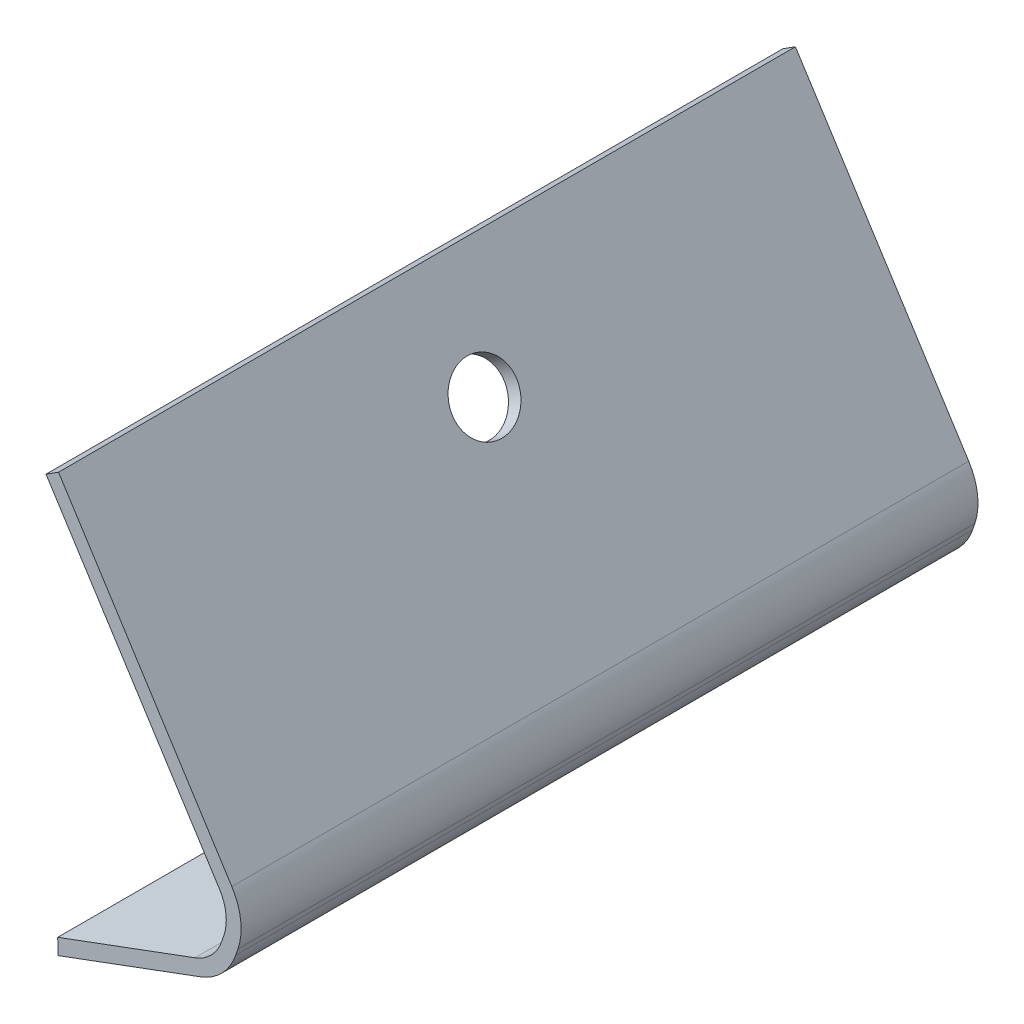
ISO-10303-21;
HEADER;
FILE_DESCRIPTION(('STEP AP214'),'2;1');
FILE_NAME('part.step','',(''),(''),'','','');
FILE_SCHEMA(('AUTOMOTIVE_DESIGN { 1 0 10303 214 1 1 1 1 }'));
ENDSEC;
DATA;
#1=APPLICATION_CONTEXT('core data for automotive mechanical design processes');
#2=APPLICATION_PROTOCOL_DEFINITION('international standard','automotive_design',2000,#1);
#3=PRODUCT_CONTEXT('',#1,'mechanical');
#4=PRODUCT('Part','Part','',(#3));
#5=PRODUCT_RELATED_PRODUCT_CATEGORY('part','',(#4));
#6=PRODUCT_DEFINITION_FORMATION('','',#4);
#7=PRODUCT_DEFINITION_CONTEXT('part definition',#1,'design');
#8=PRODUCT_DEFINITION('design','',#6,#7);
#9=PRODUCT_DEFINITION_SHAPE('','',#8);
#10=(LENGTH_UNIT() NAMED_UNIT(*) SI_UNIT(.MILLI.,.METRE.));
#11=(NAMED_UNIT(*) PLANE_ANGLE_UNIT() SI_UNIT($,.RADIAN.));
#12=(NAMED_UNIT(*) SI_UNIT($,.STERADIAN.) SOLID_ANGLE_UNIT());
#13=UNCERTAINTY_MEASURE_WITH_UNIT(LENGTH_MEASURE(1.E-05),#10,'distance_accuracy_value','');
#14=(GEOMETRIC_REPRESENTATION_CONTEXT(3) GLOBAL_UNCERTAINTY_ASSIGNED_CONTEXT((#13)) GLOBAL_UNIT_ASSIGNED_CONTEXT((#10,
#11,#12)) REPRESENTATION_CONTEXT('',''));
#15=CARTESIAN_POINT('',(0.,0.,0.));
#16=DIRECTION('',(0.,0.,1.));
#17=DIRECTION('',(1.,0.,0.));
#18=AXIS2_PLACEMENT_3D('',#15,#16,#17);
#19=CARTESIAN_POINT('',(26.2680473897416,-9.84429719392655,-206.898478212242));
#20=DIRECTION('',(0.,0.,1.));
#21=DIRECTION('',(1.,0.,0.));
#22=AXIS2_PLACEMENT_3D('',#19,#20,#21);
#23=CYLINDRICAL_SURFACE('',#22,10.16);
#24=CARTESIAN_POINT('',(26.2680473897416,-9.84429719392655,-127.762000000019));
#25=DIRECTION('',(0.,0.,-1.));
#26=DIRECTION('',(-1.,0.,0.));
#27=AXIS2_PLACEMENT_3D('',#24,#25,#26);
#28=CIRCLE('',#27,10.16);
#29=CARTESIAN_POINT('',(35.8829619273925,-13.1274387433683,-127.762000000019));
#30=VERTEX_POINT('',#29);
#31=CARTESIAN_POINT('',(29.8006851500185,-19.3703703856811,-127.762000000019));
#32=VERTEX_POINT('',#31);
#33=EDGE_CURVE('E170',#30,#32,#28,.T.);
#34=ORIENTED_EDGE('',*,*,#33,.F.);
#35=DIRECTION('',(0.,0.,1.));
#36=VECTOR('',#35,1.);
#37=CARTESIAN_POINT('',(35.8829619273925,-13.1274387433683,-206.898478212242));
#38=LINE('',#37,#36);
#39=CARTESIAN_POINT('',(35.8829619273925,-13.1274387433683,-1.5748));
#40=VERTEX_POINT('',#39);
#41=EDGE_CURVE('E37',#30,#40,#38,.T.);
#42=ORIENTED_EDGE('',*,*,#41,.T.);
#43=CARTESIAN_POINT('',(26.2680473897416,-9.84429719392655,-1.5748));
#44=DIRECTION('',(0.,0.,-1.));
#45=DIRECTION('',(-1.,0.,0.));
#46=AXIS2_PLACEMENT_3D('',#43,#44,#45);
#47=CIRCLE('',#46,10.16);
#48=CARTESIAN_POINT('',(29.8006851500185,-19.3703703856811,-1.5748));
#49=VERTEX_POINT('',#48);
#50=EDGE_CURVE('E178',#40,#49,#47,.T.);
#51=ORIENTED_EDGE('',*,*,#50,.T.);
#52=DIRECTION('',(0.,0.,1.));
#53=VECTOR('',#52,1.);
#54=CARTESIAN_POINT('',(29.8006851500185,-19.3703703856811,-206.898478212242));
#55=LINE('',#54,#53);
#56=EDGE_CURVE('E104',#32,#49,#55,.T.);
#57=ORIENTED_EDGE('',*,*,#56,.F.);
#58=EDGE_LOOP('',(#34,#42,#51,#57));
#59=FACE_BOUND('',#58,.T.);
#60=ADVANCED_FACE('F33',(#59),#23,.T.);
#61=CARTESIAN_POINT('',(30.1565219111387,-19.2384123003794,-206.898478212242));
#62=DIRECTION('',(-0.347700566956381,0.937605629109708,0.));
#63=DIRECTION('',(-0.937605629109708,-0.347700566956381,0.));
#64=AXIS2_PLACEMENT_3D('',#61,#62,#63);
#65=PLANE('',#64);
#66=DIRECTION('',(-0.937605629109708,-0.347700566956381,0.));
#67=VECTOR('',#66,1.);
#68=CARTESIAN_POINT('',(30.1565219111399,-19.238412300379,-127.762000000019));
#69=LINE('',#68,#67);
#70=CARTESIAN_POINT('',(5.43591989859728,-28.4057712287013,-127.762000000019));
#71=VERTEX_POINT('',#70);
#72=EDGE_CURVE('E111',#32,#71,#69,.T.);
#73=ORIENTED_EDGE('',*,*,#72,.F.);
#74=ORIENTED_EDGE('',*,*,#56,.T.);
#75=DIRECTION('',(-0.937605629109708,-0.347700566956381,0.));
#76=VECTOR('',#75,1.);
#77=CARTESIAN_POINT('',(30.1565219111387,-19.2384123003794,-1.5748));
#78=LINE('',#77,#76);
#79=CARTESIAN_POINT('',(5.43591989859728,-28.4057712287013,-1.5748));
#80=VERTEX_POINT('',#79);
#81=EDGE_CURVE('E177',#49,#80,#78,.T.);
#82=ORIENTED_EDGE('',*,*,#81,.T.);
#83=DIRECTION('',(0.,0.,1.));
#84=VECTOR('',#83,1.);
#85=CARTESIAN_POINT('',(5.43591989859728,-28.4057712287013,-206.898478212242));
#86=LINE('',#85,#84);
#87=EDGE_CURVE('E179',#71,#80,#86,.T.);
#88=ORIENTED_EDGE('',*,*,#87,.F.);
#89=EDGE_LOOP('',(#73,#74,#82,#88));
#90=FACE_BOUND('',#89,.T.);
#91=ADVANCED_FACE('F245',(#90),#65,.F.);
#92=CARTESIAN_POINT('',(4.50939616801551,44.9347473265458,-206.898478212242));
#93=DIRECTION('',(0.999920210973613,0.012632168716635,0.));
#94=DIRECTION('',(-0.012632168716635,0.999920210973613,0.));
#95=AXIS2_PLACEMENT_3D('',#92,#93,#94);
#96=PLANE('',#95);
#97=DIRECTION('',(-0.012632168716635,0.999920210973613,0.));
#98=VECTOR('',#97,1.);
#99=CARTESIAN_POINT('',(4.50939616801552,44.9347473265453,-127.762000000019));
#100=LINE('',#99,#98);
#101=CARTESIAN_POINT('',(5.40185585355889,-25.7093753947429,-127.762000000019));
#102=VERTEX_POINT('',#101);
#103=EDGE_CURVE('E166',#71,#102,#100,.T.);
#104=ORIENTED_EDGE('',*,*,#103,.F.);
#105=ORIENTED_EDGE('',*,*,#87,.T.);
#106=DIRECTION('',(-0.012632168716635,0.999920210973613,0.));
#107=VECTOR('',#106,1.);
#108=CARTESIAN_POINT('',(4.50939616801551,44.9347473265458,-1.5748));
#109=LINE('',#108,#107);
#110=CARTESIAN_POINT('',(5.40185585355889,-25.7093753947429,-1.5748));
#111=VERTEX_POINT('',#110);
#112=EDGE_CURVE('E181',#80,#111,#109,.T.);
#113=ORIENTED_EDGE('',*,*,#112,.T.);
#114=DIRECTION('',(0.,0.,1.));
#115=VECTOR('',#114,1.);
#116=CARTESIAN_POINT('',(5.40185585355889,-25.7093753947429,-206.898478212242));
#117=LINE('',#116,#115);
#118=EDGE_CURVE('E182',#102,#111,#117,.T.);
#119=ORIENTED_EDGE('',*,*,#118,.F.);
#120=EDGE_LOOP('',(#104,#105,#113,#119));
#121=FACE_BOUND('',#120,.T.);
#122=ADVANCED_FACE('F249',(#121),#96,.F.);
#123=CARTESIAN_POINT('',(29.2733624710695,-16.8568940024408,-206.898478212242));
#124=DIRECTION('',(0.347700566956381,-0.937605629109708,0.));
#125=DIRECTION('',(0.937605629109708,0.347700566956381,0.));
#126=AXIS2_PLACEMENT_3D('',#123,#124,#125);
#127=PLANE('',#126);
#128=DIRECTION('',(0.937605629109708,0.347700566956381,0.));
#129=VECTOR('',#128,1.);
#130=CARTESIAN_POINT('',(29.2733624710707,-16.8568940024403,-127.762000000019));
#131=LINE('',#130,#129);
#132=CARTESIAN_POINT('',(28.9175257099493,-16.9888520877425,-127.762000000019));
#133=VERTEX_POINT('',#132);
#134=EDGE_CURVE('E159',#102,#133,#131,.T.);
#135=ORIENTED_EDGE('',*,*,#134,.F.);
#136=ORIENTED_EDGE('',*,*,#118,.T.);
#137=DIRECTION('',(0.937605629109708,0.347700566956381,0.));
#138=VECTOR('',#137,1.);
#139=CARTESIAN_POINT('',(29.2733624710695,-16.8568940024408,-1.5748));
#140=LINE('',#139,#138);
#141=CARTESIAN_POINT('',(28.9175257099493,-16.9888520877425,-1.5748));
#142=VERTEX_POINT('',#141);
#143=EDGE_CURVE('E163',#111,#142,#140,.T.);
#144=ORIENTED_EDGE('',*,*,#143,.T.);
#145=DIRECTION('',(0.,0.,1.));
#146=VECTOR('',#145,1.);
#147=CARTESIAN_POINT('',(28.9175257099493,-16.9888520877425,-206.898478212242));
#148=LINE('',#147,#146);
#149=EDGE_CURVE('E162',#133,#142,#148,.T.);
#150=ORIENTED_EDGE('',*,*,#149,.F.);
#151=EDGE_LOOP('',(#135,#136,#144,#150));
#152=FACE_BOUND('',#151,.T.);
#153=ADVANCED_FACE('F254',(#152),#127,.F.);
#154=CARTESIAN_POINT('',(26.2680473897416,-9.84429719392655,-206.898478212242));
#155=DIRECTION('',(0.,0.,1.));
#156=DIRECTION('',(1.,0.,0.));
#157=AXIS2_PLACEMENT_3D('',#154,#155,#156);
#158=CYLINDRICAL_SURFACE('',#157,7.61999999999999);
#159=DIRECTION('',(0.,0.,1.));
#160=VECTOR('',#159,1.);
#161=CARTESIAN_POINT('',(33.4792332929798,-12.3066533560079,-206.898478212242));
#162=LINE('',#161,#160);
#163=CARTESIAN_POINT('',(33.4792332929798,-12.3066533560079,-127.762000000019));
#164=VERTEX_POINT('',#163);
#165=CARTESIAN_POINT('',(33.4792332929798,-12.3066533560079,-1.5748));
#166=VERTEX_POINT('',#165);
#167=EDGE_CURVE('E185',#164,#166,#162,.T.);
#168=ORIENTED_EDGE('',*,*,#167,.F.);
#169=CARTESIAN_POINT('',(26.2680473897416,-9.84429719392655,-127.762000000019));
#170=DIRECTION('',(0.,0.,-1.));
#171=DIRECTION('',(-1.,0.,0.));
#172=AXIS2_PLACEMENT_3D('',#169,#170,#171);
#173=CIRCLE('',#172,7.61999999999999);
#174=EDGE_CURVE('E160',#164,#133,#173,.T.);
#175=ORIENTED_EDGE('',*,*,#174,.T.);
#176=ORIENTED_EDGE('',*,*,#149,.T.);
#177=CARTESIAN_POINT('',(26.2680473897416,-9.84429719392655,-1.5748));
#178=DIRECTION('',(0.,0.,-1.));
#179=DIRECTION('',(-1.,0.,0.));
#180=AXIS2_PLACEMENT_3D('',#177,#178,#179);
#181=CIRCLE('',#180,7.61999999999999);
#182=EDGE_CURVE('E175',#166,#142,#181,.T.);
#183=ORIENTED_EDGE('',*,*,#182,.F.);
#184=EDGE_LOOP('',(#168,#175,#176,#183));
#185=FACE_BOUND('',#184,.T.);
#186=ADVANCED_FACE('F258',(#185),#158,.F.);
#187=CARTESIAN_POINT('',(48.1582856642763,30.6820000170771,-206.898478212242));
#188=DIRECTION('',(0.946349856068,-0.323143853291495,0.));
#189=DIRECTION('',(0.323143853291495,0.946349856068,0.));
#190=AXIS2_PLACEMENT_3D('',#187,#188,#189);
#191=PLANE('',#190);
#192=DIRECTION('',(0.323143853291495,0.946349856068,0.));
#193=VECTOR('',#192,1.);
#194=CARTESIAN_POINT('',(48.1582856642763,30.6820000170772,-127.762000000019));
#195=LINE('',#194,#193);
#196=CARTESIAN_POINT('',(33.8555594000785,-11.204555470933,-127.762000000019));
#197=VERTEX_POINT('',#196);
#198=EDGE_CURVE('E152',#164,#197,#195,.T.);
#199=ORIENTED_EDGE('',*,*,#198,.F.);
#200=ORIENTED_EDGE('',*,*,#167,.T.);
#201=DIRECTION('',(0.323143853291495,0.946349856068,0.));
#202=VECTOR('',#201,1.);
#203=CARTESIAN_POINT('',(48.1582856642763,30.6820000170771,-1.5748));
#204=LINE('',#203,#202);
#205=CARTESIAN_POINT('',(33.8555594000785,-11.204555470933,-1.5748));
#206=VERTEX_POINT('',#205);
#207=EDGE_CURVE('E156',#166,#206,#204,.T.);
#208=ORIENTED_EDGE('',*,*,#207,.T.);
#209=DIRECTION('',(0.,0.,1.));
#210=VECTOR('',#209,1.);
#211=CARTESIAN_POINT('',(33.8555594000785,-11.204555470933,-206.898478212242));
#212=LINE('',#211,#210);
#213=EDGE_CURVE('E155',#197,#206,#212,.T.);
#214=ORIENTED_EDGE('',*,*,#213,.F.);
#215=EDGE_LOOP('',(#199,#200,#208,#214));
#216=FACE_BOUND('',#215,.T.);
#217=ADVANCED_FACE('F262',(#216),#191,.F.);
#218=CARTESIAN_POINT('',(26.6443734968404,-8.74219930885168,-206.898478212242));
#219=DIRECTION('',(0.,0.,1.));
#220=DIRECTION('',(1.,0.,0.));
#221=AXIS2_PLACEMENT_3D('',#218,#219,#220);
#222=CYLINDRICAL_SURFACE('',#221,7.62);
#223=DIRECTION('',(0.,0.,1.));
#224=VECTOR('',#223,1.);
#225=CARTESIAN_POINT('',(33.072353420899,-4.65007588746044,-206.898478212242));
#226=LINE('',#225,#224);
#227=CARTESIAN_POINT('',(33.072353420899,-4.65007588746044,-127.762000000019));
#228=VERTEX_POINT('',#227);
#229=CARTESIAN_POINT('',(33.072353420899,-4.65007588746044,-1.5748));
#230=VERTEX_POINT('',#229);
#231=EDGE_CURVE('E188',#228,#230,#226,.T.);
#232=ORIENTED_EDGE('',*,*,#231,.F.);
#233=CARTESIAN_POINT('',(26.6443734968404,-8.74219930885168,-127.762000000019));
#234=DIRECTION('',(0.,0.,-1.));
#235=DIRECTION('',(-1.,0.,0.));
#236=AXIS2_PLACEMENT_3D('',#233,#234,#235);
#237=CIRCLE('',#236,7.62);
#238=EDGE_CURVE('E153',#228,#197,#237,.T.);
#239=ORIENTED_EDGE('',*,*,#238,.T.);
#240=ORIENTED_EDGE('',*,*,#213,.T.);
#241=CARTESIAN_POINT('',(26.6443734968404,-8.74219930885168,-1.5748));
#242=DIRECTION('',(0.,0.,-1.));
#243=DIRECTION('',(-1.,0.,0.));
#244=AXIS2_PLACEMENT_3D('',#241,#242,#243);
#245=CIRCLE('',#244,7.62);
#246=EDGE_CURVE('E196',#230,#206,#245,.T.);
#247=ORIENTED_EDGE('',*,*,#246,.F.);
#248=EDGE_LOOP('',(#232,#239,#240,#247));
#249=FACE_BOUND('',#248,.T.);
#250=ADVANCED_FACE('F266',(#249),#222,.F.);
#251=CARTESIAN_POINT('',(2.89252497295236,42.7569329922919,-206.898478212242));
#252=DIRECTION('',(0.843566919167806,0.537024071048716,0.));
#253=DIRECTION('',(-0.537024071048717,0.843566919167806,0.));
#254=AXIS2_PLACEMENT_3D('',#251,#252,#253);
#255=PLANE('',#254);
#256=CARTESIAN_POINT('',(13.2508185158128,26.4859420947649,-64.6684000000046));
#257=DIRECTION('',(0.843566919167806,0.537024071048716,0.));
#258=DIRECTION('',(-0.537024071048717,0.843566919167806,0.));
#259=AXIS2_PLACEMENT_3D('',#256,#257,#258);
#260=CIRCLE('',#259,5.4999870263317);
#261=CARTESIAN_POINT('',(10.297193092217,31.1255492060304,-64.6684000000046));
#262=VERTEX_POINT('',#261);
#263=EDGE_CURVE('E220',#262,#262,#260,.T.);
#264=ORIENTED_EDGE('',*,*,#263,.T.);
#265=EDGE_LOOP('',(#264));
#266=FACE_BOUND('',#265,.T.);
#267=DIRECTION('',(-0.537024071048717,0.843566919167806,0.));
#268=VECTOR('',#267,1.);
#269=CARTESIAN_POINT('',(2.89252497295298,42.7569329922909,-127.762000000019));
#270=LINE('',#269,#268);
#271=CARTESIAN_POINT('',(3.39454002531348,41.9683588595363,-127.762000000019));
#272=VERTEX_POINT('',#271);
#273=EDGE_CURVE('E147',#228,#272,#270,.T.);
#274=ORIENTED_EDGE('',*,*,#273,.F.);
#275=ORIENTED_EDGE('',*,*,#231,.T.);
#276=DIRECTION('',(-0.537024071048717,0.843566919167806,0.));
#277=VECTOR('',#276,1.);
#278=CARTESIAN_POINT('',(2.89252497295236,42.7569329922919,-1.5748));
#279=LINE('',#278,#277);
#280=CARTESIAN_POINT('',(3.39454002531348,41.9683588595363,-1.5748));
#281=VERTEX_POINT('',#280);
#282=EDGE_CURVE('E190',#230,#281,#279,.T.);
#283=ORIENTED_EDGE('',*,*,#282,.T.);
#284=DIRECTION('',(0.,0.,1.));
#285=VECTOR('',#284,1.);
#286=CARTESIAN_POINT('',(3.39454002531348,41.9683588595363,-206.898478212242));
#287=LINE('',#286,#285);
#288=EDGE_CURVE('E191',#272,#281,#287,.T.);
#289=ORIENTED_EDGE('',*,*,#288,.F.);
#290=EDGE_LOOP('',(#274,#275,#283,#289));
#291=FACE_BOUND('',#290,.T.);
#292=ADVANCED_FACE('F241',(#266,#291),#255,.F.);
#293=CARTESIAN_POINT('',(6.85201505236082,44.1694258672444,-206.898478212242));
#294=DIRECTION('',(0.537024071048717,-0.843566919167805,0.));
#295=DIRECTION('',(0.843566919167806,0.537024071048717,0.));
#296=AXIS2_PLACEMENT_3D('',#293,#294,#295);
#297=PLANE('',#296);
#298=DIRECTION('',(0.843566919167806,0.537024071048717,0.));
#299=VECTOR('',#298,1.);
#300=CARTESIAN_POINT('',(6.8520150523617,44.169425867245,-127.762000000019));
#301=LINE('',#300,#299);
#302=CARTESIAN_POINT('',(5.53719999999971,43.3324,-127.762000000019));
#303=VERTEX_POINT('',#302);
#304=EDGE_CURVE('E145',#272,#303,#301,.T.);
#305=ORIENTED_EDGE('',*,*,#304,.F.);
#306=ORIENTED_EDGE('',*,*,#288,.T.);
#307=DIRECTION('',(0.843566919167806,0.537024071048717,0.));
#308=VECTOR('',#307,1.);
#309=CARTESIAN_POINT('',(6.85201505236082,44.1694258672444,-1.5748));
#310=LINE('',#309,#308);
#311=CARTESIAN_POINT('',(5.53719999999971,43.3324,-1.5748));
#312=VERTEX_POINT('',#311);
#313=EDGE_CURVE('E193',#281,#312,#310,.T.);
#314=ORIENTED_EDGE('',*,*,#313,.T.);
#315=DIRECTION('',(0.,0.,1.));
#316=VECTOR('',#315,1.);
#317=CARTESIAN_POINT('',(5.53719999999971,43.3324,-206.898478212242));
#318=LINE('',#317,#316);
#319=EDGE_CURVE('E194',#303,#312,#318,.T.);
#320=ORIENTED_EDGE('',*,*,#319,.F.);
#321=EDGE_LOOP('',(#305,#306,#314,#320));
#322=FACE_BOUND('',#321,.T.);
#323=ADVANCED_FACE('F233',(#322),#297,.F.);
#324=CARTESIAN_POINT('',(5.03518494763858,44.1209741327557,-206.898478212242));
#325=DIRECTION('',(-0.843566919167806,-0.537024071048717,0.));
#326=DIRECTION('',(0.537024071048717,-0.843566919167806,0.));
#327=AXIS2_PLACEMENT_3D('',#324,#325,#326);
#328=PLANE('',#327);
#329=CARTESIAN_POINT('',(15.393478490499,27.8499832352286,-64.6684000000046));
#330=DIRECTION('',(0.843566919167805,0.537024071048717,0.));
#331=DIRECTION('',(-0.537024071048717,0.843566919167806,0.));
#332=AXIS2_PLACEMENT_3D('',#329,#330,#331);
#333=CIRCLE('',#332,5.4999870263317);
#334=CARTESIAN_POINT('',(12.4398530669033,32.4895903464942,-64.6684000000046));
#335=VERTEX_POINT('',#334);
#336=EDGE_CURVE('E222',#335,#335,#333,.T.);
#337=ORIENTED_EDGE('',*,*,#336,.F.);
#338=EDGE_LOOP('',(#337));
#339=FACE_BOUND('',#338,.T.);
#340=DIRECTION('',(0.537024071048717,-0.843566919167806,0.));
#341=VECTOR('',#340,1.);
#342=CARTESIAN_POINT('',(5.03518494763921,44.1209741327547,-127.762000000019));
#343=LINE('',#342,#341);
#344=CARTESIAN_POINT('',(35.2150133955852,-3.28603474699668,-127.762000000019));
#345=VERTEX_POINT('',#344);
#346=EDGE_CURVE('E42',#303,#345,#343,.T.);
#347=ORIENTED_EDGE('',*,*,#346,.F.);
#348=ORIENTED_EDGE('',*,*,#319,.T.);
#349=DIRECTION('',(0.537024071048717,-0.843566919167806,0.));
#350=VECTOR('',#349,1.);
#351=CARTESIAN_POINT('',(5.03518494763858,44.1209741327557,-1.5748));
#352=LINE('',#351,#350);
#353=CARTESIAN_POINT('',(35.2150133955852,-3.28603474699668,-1.5748));
#354=VERTEX_POINT('',#353);
#355=EDGE_CURVE('E139',#312,#354,#352,.T.);
#356=ORIENTED_EDGE('',*,*,#355,.T.);
#357=DIRECTION('',(0.,0.,1.));
#358=VECTOR('',#357,1.);
#359=CARTESIAN_POINT('',(35.2150133955852,-3.28603474699668,-206.898478212242));
#360=LINE('',#359,#358);
#361=EDGE_CURVE('E130',#345,#354,#360,.T.);
#362=ORIENTED_EDGE('',*,*,#361,.F.);
#363=EDGE_LOOP('',(#347,#348,#356,#362));
#364=FACE_BOUND('',#363,.T.);
#365=ADVANCED_FACE('F136',(#339,#364),#328,.F.);
#366=CARTESIAN_POINT('',(26.6443734968404,-8.74219930885168,-206.898478212242));
#367=DIRECTION('',(0.,0.,1.));
#368=DIRECTION('',(1.,0.,0.));
#369=AXIS2_PLACEMENT_3D('',#366,#367,#368);
#370=CYLINDRICAL_SURFACE('',#369,10.16);
#371=CARTESIAN_POINT('',(26.6443734968404,-8.74219930885168,-127.762000000019));
#372=DIRECTION('',(0.,0.,-1.));
#373=DIRECTION('',(-1.,0.,0.));
#374=AXIS2_PLACEMENT_3D('',#371,#372,#373);
#375=CIRCLE('',#374,10.16);
#376=CARTESIAN_POINT('',(36.2592880344912,-12.0253408582934,-127.762000000019));
#377=VERTEX_POINT('',#376);
#378=EDGE_CURVE('E11',#345,#377,#375,.T.);
#379=ORIENTED_EDGE('',*,*,#378,.F.);
#380=ORIENTED_EDGE('',*,*,#361,.T.);
#381=CARTESIAN_POINT('',(26.6443734968404,-8.74219930885168,-1.5748));
#382=DIRECTION('',(0.,0.,-1.));
#383=DIRECTION('',(-1.,0.,0.));
#384=AXIS2_PLACEMENT_3D('',#381,#382,#383);
#385=CIRCLE('',#384,10.16);
#386=CARTESIAN_POINT('',(36.2592880344912,-12.0253408582934,-1.5748));
#387=VERTEX_POINT('',#386);
#388=EDGE_CURVE('E141',#354,#387,#385,.T.);
#389=ORIENTED_EDGE('',*,*,#388,.T.);
#390=DIRECTION('',(0.,0.,1.));
#391=VECTOR('',#390,1.);
#392=CARTESIAN_POINT('',(36.2592880344912,-12.0253408582934,-206.898478212242));
#393=LINE('',#392,#391);
#394=EDGE_CURVE('E55',#377,#387,#393,.T.);
#395=ORIENTED_EDGE('',*,*,#394,.F.);
#396=EDGE_LOOP('',(#379,#380,#389,#395));
#397=FACE_BOUND('',#396,.T.);
#398=ADVANCED_FACE('F129',(#397),#370,.T.);
#399=CARTESIAN_POINT('',(50.5620142986893,29.8612146297161,-206.898478212242));
#400=DIRECTION('',(-0.946349856067997,0.323143853291505,0.));
#401=DIRECTION('',(-0.323143853291505,-0.946349856067997,0.));
#402=AXIS2_PLACEMENT_3D('',#399,#400,#401);
#403=PLANE('',#402);
#404=DIRECTION('',(-0.323143853291505,-0.946349856067997,0.));
#405=VECTOR('',#404,1.);
#406=CARTESIAN_POINT('',(50.5620142986893,29.8612146297162,-127.762000000019));
#407=LINE('',#406,#405);
#408=EDGE_CURVE('E173',#377,#30,#407,.T.);
#409=ORIENTED_EDGE('',*,*,#408,.F.);
#410=ORIENTED_EDGE('',*,*,#394,.T.);
#411=DIRECTION('',(-0.323143853291505,-0.946349856067997,0.));
#412=VECTOR('',#411,1.);
#413=CARTESIAN_POINT('',(50.5620142986893,29.8612146297161,-1.5748));
#414=LINE('',#413,#412);
#415=EDGE_CURVE('E195',#387,#40,#414,.T.);
#416=ORIENTED_EDGE('',*,*,#415,.T.);
#417=ORIENTED_EDGE('',*,*,#41,.F.);
#418=EDGE_LOOP('',(#409,#410,#416,#417));
#419=FACE_BOUND('',#418,.T.);
#420=ADVANCED_FACE('F239',(#419),#403,.F.);
#421=CARTESIAN_POINT('',(26.2680473897416,-9.84429719392655,-1.5748));
#422=DIRECTION('',(0.,0.,-1.));
#423=DIRECTION('',(-1.,0.,0.));
#424=AXIS2_PLACEMENT_3D('',#421,#422,#423);
#425=PLANE('',#424);
#426=ORIENTED_EDGE('',*,*,#50,.F.);
#427=ORIENTED_EDGE('',*,*,#415,.F.);
#428=ORIENTED_EDGE('',*,*,#388,.F.);
#429=ORIENTED_EDGE('',*,*,#355,.F.);
#430=ORIENTED_EDGE('',*,*,#313,.F.);
#431=ORIENTED_EDGE('',*,*,#282,.F.);
#432=ORIENTED_EDGE('',*,*,#246,.T.);
#433=ORIENTED_EDGE('',*,*,#207,.F.);
#434=ORIENTED_EDGE('',*,*,#182,.T.);
#435=ORIENTED_EDGE('',*,*,#143,.F.);
#436=ORIENTED_EDGE('',*,*,#112,.F.);
#437=ORIENTED_EDGE('',*,*,#81,.F.);
#438=EDGE_LOOP('',(#426,#427,#428,#429,#430,#431,#432,#433,#434,#435,#436,#437));
#439=FACE_BOUND('',#438,.T.);
#440=ADVANCED_FACE('F288',(#439),#425,.F.);
#441=CARTESIAN_POINT('',(6.34999999999659,44.9579999999958,-127.762000000019));
#442=DIRECTION('',(0.,0.,-1.));
#443=DIRECTION('',(-1.,0.,0.));
#444=AXIS2_PLACEMENT_3D('',#441,#442,#443);
#445=PLANE('',#444);
#446=ORIENTED_EDGE('',*,*,#408,.T.);
#447=ORIENTED_EDGE('',*,*,#33,.T.);
#448=ORIENTED_EDGE('',*,*,#72,.T.);
#449=ORIENTED_EDGE('',*,*,#103,.T.);
#450=ORIENTED_EDGE('',*,*,#134,.T.);
#451=ORIENTED_EDGE('',*,*,#174,.F.);
#452=ORIENTED_EDGE('',*,*,#198,.T.);
#453=ORIENTED_EDGE('',*,*,#238,.F.);
#454=ORIENTED_EDGE('',*,*,#273,.T.);
#455=ORIENTED_EDGE('',*,*,#304,.T.);
#456=ORIENTED_EDGE('',*,*,#346,.T.);
#457=ORIENTED_EDGE('',*,*,#378,.T.);
#458=EDGE_LOOP('',(#446,#447,#448,#449,#450,#451,#452,#453,#454,#455,#456,#457));
#459=FACE_BOUND('',#458,.T.);
#460=ADVANCED_FACE('F35',(#459),#445,.T.);
#461=CARTESIAN_POINT('',(-38.1730208766566,-6.25104527636487,-64.6684000000046));
#462=DIRECTION('',(0.843566919167806,0.537024071048716,0.));
#463=DIRECTION('',(-0.537024071048717,0.843566919167806,0.));
#464=AXIS2_PLACEMENT_3D('',#461,#462,#463);
#465=CYLINDRICAL_SURFACE('',#464,5.4999870263317);
#466=ORIENTED_EDGE('',*,*,#336,.T.);
#467=EDGE_LOOP('',(#466));
#468=FACE_BOUND('',#467,.T.);
#469=ORIENTED_EDGE('',*,*,#263,.F.);
#470=EDGE_LOOP('',(#469));
#471=FACE_BOUND('',#470,.T.);
#472=ADVANCED_FACE('F229',(#468,#471),#465,.F.);
#473=CLOSED_SHELL('',(#60,#91,#122,#153,#186,#217,#250,#292,#323,#365,#398,#420,#440,#460,#472));
#474=MANIFOLD_SOLID_BREP('B2',#473);
#475=ADVANCED_BREP_SHAPE_REPRESENTATION('',(#18,#474),#14);
#476=SHAPE_DEFINITION_REPRESENTATION(#9,#475);
ENDSEC;
END-ISO-10303-21;
